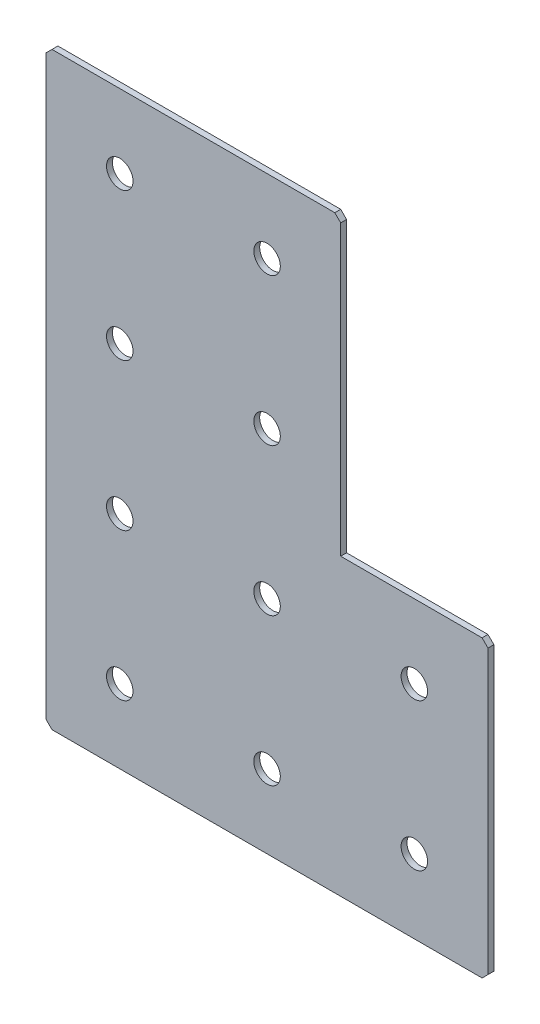
ISO-10303-21;
HEADER;
FILE_DESCRIPTION(('STEP AP214'),'2;1');
FILE_NAME('part.step','',(''),(''),'','','');
FILE_SCHEMA(('AUTOMOTIVE_DESIGN { 1 0 10303 214 1 1 1 1 }'));
ENDSEC;
DATA;
#1=APPLICATION_CONTEXT('core data for automotive mechanical design processes');
#2=APPLICATION_PROTOCOL_DEFINITION('international standard','automotive_design',2000,#1);
#3=PRODUCT_CONTEXT('',#1,'mechanical');
#4=PRODUCT('Part','Part','',(#3));
#5=PRODUCT_RELATED_PRODUCT_CATEGORY('part','',(#4));
#6=PRODUCT_DEFINITION_FORMATION('','',#4);
#7=PRODUCT_DEFINITION_CONTEXT('part definition',#1,'design');
#8=PRODUCT_DEFINITION('design','',#6,#7);
#9=PRODUCT_DEFINITION_SHAPE('','',#8);
#10=(LENGTH_UNIT() NAMED_UNIT(*) SI_UNIT(.MILLI.,.METRE.));
#11=(NAMED_UNIT(*) PLANE_ANGLE_UNIT() SI_UNIT($,.RADIAN.));
#12=(NAMED_UNIT(*) SI_UNIT($,.STERADIAN.) SOLID_ANGLE_UNIT());
#13=UNCERTAINTY_MEASURE_WITH_UNIT(LENGTH_MEASURE(1.E-05),#10,'distance_accuracy_value','');
#14=(GEOMETRIC_REPRESENTATION_CONTEXT(3) GLOBAL_UNCERTAINTY_ASSIGNED_CONTEXT((#13)) GLOBAL_UNIT_ASSIGNED_CONTEXT((#10,
#11,#12)) REPRESENTATION_CONTEXT('',''));
#15=CARTESIAN_POINT('',(0.,0.,0.));
#16=DIRECTION('',(0.,0.,1.));
#17=DIRECTION('',(1.,0.,0.));
#18=AXIS2_PLACEMENT_3D('',#15,#16,#17);
#19=CARTESIAN_POINT('',(100.,0.,-2.));
#20=DIRECTION('',(0.,-1.,0.));
#21=DIRECTION('',(1.,0.,0.));
#22=AXIS2_PLACEMENT_3D('',#19,#20,#21);
#23=PLANE('',#22);
#24=DIRECTION('',(1.,0.,0.));
#25=VECTOR('',#24,1.);
#26=CARTESIAN_POINT('',(100.,0.,0.));
#27=LINE('',#26,#25);
#28=CARTESIAN_POINT('',(2.,0.,0.));
#29=VERTEX_POINT('',#28);
#30=CARTESIAN_POINT('',(98.,0.,0.));
#31=VERTEX_POINT('',#30);
#32=EDGE_CURVE('E158',#29,#31,#27,.T.);
#33=ORIENTED_EDGE('',*,*,#32,.T.);
#34=DIRECTION('',(0.,0.,-1.));
#35=VECTOR('',#34,1.);
#36=CARTESIAN_POINT('',(98.,0.,-2.));
#37=LINE('',#36,#35);
#38=CARTESIAN_POINT('',(98.,0.,-2.));
#39=VERTEX_POINT('',#38);
#40=EDGE_CURVE('E201',#31,#39,#37,.T.);
#41=ORIENTED_EDGE('',*,*,#40,.T.);
#42=DIRECTION('',(1.,0.,0.));
#43=VECTOR('',#42,1.);
#44=CARTESIAN_POINT('',(100.,0.,-2.));
#45=LINE('',#44,#43);
#46=CARTESIAN_POINT('',(2.,0.,-2.));
#47=VERTEX_POINT('',#46);
#48=EDGE_CURVE('E133',#47,#39,#45,.T.);
#49=ORIENTED_EDGE('',*,*,#48,.F.);
#50=DIRECTION('',(0.,0.,1.));
#51=VECTOR('',#50,1.);
#52=CARTESIAN_POINT('',(2.,0.,-2.));
#53=LINE('',#52,#51);
#54=EDGE_CURVE('E198',#47,#29,#53,.T.);
#55=ORIENTED_EDGE('',*,*,#54,.T.);
#56=EDGE_LOOP('',(#33,#41,#49,#55));
#57=FACE_BOUND('',#56,.T.);
#58=ADVANCED_FACE('F37',(#57),#23,.F.);
#59=CARTESIAN_POINT('',(100.,-100.,-2.));
#60=DIRECTION('',(-1.,0.,0.));
#61=DIRECTION('',(0.,-1.,0.));
#62=AXIS2_PLACEMENT_3D('',#59,#60,#61);
#63=PLANE('',#62);
#64=DIRECTION('',(0.,-1.,0.));
#65=VECTOR('',#64,1.);
#66=CARTESIAN_POINT('',(100.,-100.,-2.));
#67=LINE('',#66,#65);
#68=CARTESIAN_POINT('',(100.,-1.99999999999995,-2.));
#69=VERTEX_POINT('',#68);
#70=CARTESIAN_POINT('',(100.,-100.,-2.));
#71=VERTEX_POINT('',#70);
#72=EDGE_CURVE('E121',#69,#71,#67,.T.);
#73=ORIENTED_EDGE('',*,*,#72,.F.);
#74=DIRECTION('',(0.,0.,1.));
#75=VECTOR('',#74,1.);
#76=CARTESIAN_POINT('',(100.,-1.99999999999995,-2.));
#77=LINE('',#76,#75);
#78=CARTESIAN_POINT('',(100.,-1.99999999999995,0.));
#79=VERTEX_POINT('',#78);
#80=EDGE_CURVE('E196',#69,#79,#77,.T.);
#81=ORIENTED_EDGE('',*,*,#80,.T.);
#82=DIRECTION('',(0.,-1.,0.));
#83=VECTOR('',#82,1.);
#84=CARTESIAN_POINT('',(100.,-100.,0.));
#85=LINE('',#84,#83);
#86=CARTESIAN_POINT('',(100.,-100.,0.));
#87=VERTEX_POINT('',#86);
#88=EDGE_CURVE('E139',#79,#87,#85,.T.);
#89=ORIENTED_EDGE('',*,*,#88,.T.);
#90=DIRECTION('',(0.,0.,1.));
#91=VECTOR('',#90,1.);
#92=CARTESIAN_POINT('',(100.,-100.,-2.));
#93=LINE('',#92,#91);
#94=EDGE_CURVE('E136',#71,#87,#93,.T.);
#95=ORIENTED_EDGE('',*,*,#94,.F.);
#96=EDGE_LOOP('',(#73,#81,#89,#95));
#97=FACE_BOUND('',#96,.T.);
#98=ADVANCED_FACE('F137',(#97),#63,.F.);
#99=CARTESIAN_POINT('',(150.,-100.,-2.));
#100=DIRECTION('',(0.,-1.,0.));
#101=DIRECTION('',(0.,0.,-1.));
#102=AXIS2_PLACEMENT_3D('',#99,#100,#101);
#103=PLANE('',#102);
#104=DIRECTION('',(1.,0.,0.));
#105=VECTOR('',#104,1.);
#106=CARTESIAN_POINT('',(150.,-100.,0.));
#107=LINE('',#106,#105);
#108=CARTESIAN_POINT('',(148.,-100.,0.));
#109=VERTEX_POINT('',#108);
#110=EDGE_CURVE('E163',#87,#109,#107,.T.);
#111=ORIENTED_EDGE('',*,*,#110,.T.);
#112=DIRECTION('',(0.,0.,-1.));
#113=VECTOR('',#112,1.);
#114=CARTESIAN_POINT('',(148.,-100.,-2.));
#115=LINE('',#114,#113);
#116=CARTESIAN_POINT('',(148.,-100.,-2.));
#117=VERTEX_POINT('',#116);
#118=EDGE_CURVE('E148',#109,#117,#115,.T.);
#119=ORIENTED_EDGE('',*,*,#118,.T.);
#120=DIRECTION('',(1.,0.,0.));
#121=VECTOR('',#120,1.);
#122=CARTESIAN_POINT('',(150.,-100.,-2.));
#123=LINE('',#122,#121);
#124=EDGE_CURVE('E125',#71,#117,#123,.T.);
#125=ORIENTED_EDGE('',*,*,#124,.F.);
#126=ORIENTED_EDGE('',*,*,#94,.T.);
#127=EDGE_LOOP('',(#111,#119,#125,#126));
#128=FACE_BOUND('',#127,.T.);
#129=ADVANCED_FACE('F146',(#128),#103,.F.);
#130=CARTESIAN_POINT('',(150.,-200.,-2.));
#131=DIRECTION('',(-1.,0.,0.));
#132=DIRECTION('',(0.,-1.,0.));
#133=AXIS2_PLACEMENT_3D('',#130,#131,#132);
#134=PLANE('',#133);
#135=DIRECTION('',(0.,-1.,0.));
#136=VECTOR('',#135,1.);
#137=CARTESIAN_POINT('',(150.,-200.,-2.));
#138=LINE('',#137,#136);
#139=CARTESIAN_POINT('',(150.,-102.,-2.));
#140=VERTEX_POINT('',#139);
#141=CARTESIAN_POINT('',(150.,-198.,-2.));
#142=VERTEX_POINT('',#141);
#143=EDGE_CURVE('E149',#140,#142,#138,.T.);
#144=ORIENTED_EDGE('',*,*,#143,.F.);
#145=DIRECTION('',(0.,0.,1.));
#146=VECTOR('',#145,1.);
#147=CARTESIAN_POINT('',(150.,-102.,-2.));
#148=LINE('',#147,#146);
#149=CARTESIAN_POINT('',(150.,-102.,0.));
#150=VERTEX_POINT('',#149);
#151=EDGE_CURVE('E174',#140,#150,#148,.T.);
#152=ORIENTED_EDGE('',*,*,#151,.T.);
#153=DIRECTION('',(0.,-1.,0.));
#154=VECTOR('',#153,1.);
#155=CARTESIAN_POINT('',(150.,-200.,0.));
#156=LINE('',#155,#154);
#157=CARTESIAN_POINT('',(150.,-198.,0.));
#158=VERTEX_POINT('',#157);
#159=EDGE_CURVE('E165',#150,#158,#156,.T.);
#160=ORIENTED_EDGE('',*,*,#159,.T.);
#161=DIRECTION('',(0.,0.,-1.));
#162=VECTOR('',#161,1.);
#163=CARTESIAN_POINT('',(150.,-198.,-2.));
#164=LINE('',#163,#162);
#165=EDGE_CURVE('E143',#158,#142,#164,.T.);
#166=ORIENTED_EDGE('',*,*,#165,.T.);
#167=EDGE_LOOP('',(#144,#152,#160,#166));
#168=FACE_BOUND('',#167,.T.);
#169=ADVANCED_FACE('F353',(#168),#134,.F.);
#170=CARTESIAN_POINT('',(0.,-200.,-2.));
#171=DIRECTION('',(0.,1.,0.));
#172=DIRECTION('',(0.,0.,1.));
#173=AXIS2_PLACEMENT_3D('',#170,#171,#172);
#174=PLANE('',#173);
#175=DIRECTION('',(-1.,0.,0.));
#176=VECTOR('',#175,1.);
#177=CARTESIAN_POINT('',(0.,-200.,-2.));
#178=LINE('',#177,#176);
#179=CARTESIAN_POINT('',(148.,-200.,-2.));
#180=VERTEX_POINT('',#179);
#181=CARTESIAN_POINT('',(2.00000000000003,-200.,-2.));
#182=VERTEX_POINT('',#181);
#183=EDGE_CURVE('E152',#180,#182,#178,.T.);
#184=ORIENTED_EDGE('',*,*,#183,.F.);
#185=DIRECTION('',(0.,0.,1.));
#186=VECTOR('',#185,1.);
#187=CARTESIAN_POINT('',(148.,-200.,-2.));
#188=LINE('',#187,#186);
#189=CARTESIAN_POINT('',(148.,-200.,0.));
#190=VERTEX_POINT('',#189);
#191=EDGE_CURVE('E11',#180,#190,#188,.T.);
#192=ORIENTED_EDGE('',*,*,#191,.T.);
#193=DIRECTION('',(-1.,0.,0.));
#194=VECTOR('',#193,1.);
#195=CARTESIAN_POINT('',(0.,-200.,0.));
#196=LINE('',#195,#194);
#197=CARTESIAN_POINT('',(2.00000000000003,-200.,0.));
#198=VERTEX_POINT('',#197);
#199=EDGE_CURVE('E168',#190,#198,#196,.T.);
#200=ORIENTED_EDGE('',*,*,#199,.T.);
#201=DIRECTION('',(0.,0.,-1.));
#202=VECTOR('',#201,1.);
#203=CARTESIAN_POINT('',(2.00000000000003,-200.,-2.));
#204=LINE('',#203,#202);
#205=EDGE_CURVE('E45',#198,#182,#204,.T.);
#206=ORIENTED_EDGE('',*,*,#205,.T.);
#207=EDGE_LOOP('',(#184,#192,#200,#206));
#208=FACE_BOUND('',#207,.T.);
#209=ADVANCED_FACE('F209',(#208),#174,.F.);
#210=CARTESIAN_POINT('',(0.,0.,-2.));
#211=DIRECTION('',(1.,0.,0.));
#212=DIRECTION('',(0.,0.,-1.));
#213=AXIS2_PLACEMENT_3D('',#210,#211,#212);
#214=PLANE('',#213);
#215=DIRECTION('',(0.,1.,0.));
#216=VECTOR('',#215,1.);
#217=CARTESIAN_POINT('',(0.,0.,0.));
#218=LINE('',#217,#216);
#219=CARTESIAN_POINT('',(0.,-198.,0.));
#220=VERTEX_POINT('',#219);
#221=CARTESIAN_POINT('',(0.,-2.,0.));
#222=VERTEX_POINT('',#221);
#223=EDGE_CURVE('E171',#220,#222,#218,.T.);
#224=ORIENTED_EDGE('',*,*,#223,.T.);
#225=DIRECTION('',(0.,0.,-1.));
#226=VECTOR('',#225,1.);
#227=CARTESIAN_POINT('',(0.,-2.,-2.));
#228=LINE('',#227,#226);
#229=CARTESIAN_POINT('',(0.,-2.,-2.));
#230=VERTEX_POINT('',#229);
#231=EDGE_CURVE('E52',#222,#230,#228,.T.);
#232=ORIENTED_EDGE('',*,*,#231,.T.);
#233=DIRECTION('',(0.,1.,0.));
#234=VECTOR('',#233,1.);
#235=CARTESIAN_POINT('',(0.,0.,-2.));
#236=LINE('',#235,#234);
#237=CARTESIAN_POINT('',(0.,-198.,-2.));
#238=VERTEX_POINT('',#237);
#239=EDGE_CURVE('E144',#238,#230,#236,.T.);
#240=ORIENTED_EDGE('',*,*,#239,.F.);
#241=DIRECTION('',(0.,0.,1.));
#242=VECTOR('',#241,1.);
#243=CARTESIAN_POINT('',(0.,-198.,-2.));
#244=LINE('',#243,#242);
#245=EDGE_CURVE('E203',#238,#220,#244,.T.);
#246=ORIENTED_EDGE('',*,*,#245,.T.);
#247=EDGE_LOOP('',(#224,#232,#240,#246));
#248=FACE_BOUND('',#247,.T.);
#249=ADVANCED_FACE('F216',(#248),#214,.F.);
#250=CARTESIAN_POINT('',(0.,0.,-2.));
#251=DIRECTION('',(0.,0.,1.));
#252=DIRECTION('',(1.,0.,0.));
#253=AXIS2_PLACEMENT_3D('',#250,#251,#252);
#254=PLANE('',#253);
#255=CARTESIAN_POINT('',(25.,-175.,-2.00000000000001));
#256=DIRECTION('',(0.,0.,-1.));
#257=DIRECTION('',(0.,1.,0.));
#258=AXIS2_PLACEMENT_3D('',#255,#256,#257);
#259=CIRCLE('',#258,4.5);
#260=CARTESIAN_POINT('',(25.,-170.5,-2.00000000000001));
#261=VERTEX_POINT('',#260);
#262=EDGE_CURVE('E285',#261,#261,#259,.T.);
#263=ORIENTED_EDGE('',*,*,#262,.F.);
#264=EDGE_LOOP('',(#263));
#265=FACE_BOUND('',#264,.T.);
#266=CARTESIAN_POINT('',(25.,-125.,-2.00000000000001));
#267=DIRECTION('',(0.,0.,-1.));
#268=DIRECTION('',(0.,1.,0.));
#269=AXIS2_PLACEMENT_3D('',#266,#267,#268);
#270=CIRCLE('',#269,4.5);
#271=CARTESIAN_POINT('',(25.,-120.5,-2.00000000000001));
#272=VERTEX_POINT('',#271);
#273=EDGE_CURVE('E279',#272,#272,#270,.T.);
#274=ORIENTED_EDGE('',*,*,#273,.F.);
#275=EDGE_LOOP('',(#274));
#276=FACE_BOUND('',#275,.T.);
#277=CARTESIAN_POINT('',(25.,-75.,-2.));
#278=DIRECTION('',(0.,0.,-1.));
#279=DIRECTION('',(0.,1.,0.));
#280=AXIS2_PLACEMENT_3D('',#277,#278,#279);
#281=CIRCLE('',#280,4.5);
#282=CARTESIAN_POINT('',(25.,-70.5,-2.));
#283=VERTEX_POINT('',#282);
#284=EDGE_CURVE('E273',#283,#283,#281,.T.);
#285=ORIENTED_EDGE('',*,*,#284,.F.);
#286=EDGE_LOOP('',(#285));
#287=FACE_BOUND('',#286,.T.);
#288=CARTESIAN_POINT('',(25.,-25.,-2.));
#289=DIRECTION('',(0.,0.,-1.));
#290=DIRECTION('',(0.,1.,0.));
#291=AXIS2_PLACEMENT_3D('',#288,#289,#290);
#292=CIRCLE('',#291,4.5);
#293=CARTESIAN_POINT('',(25.,-20.5,-2.));
#294=VERTEX_POINT('',#293);
#295=EDGE_CURVE('E267',#294,#294,#292,.T.);
#296=ORIENTED_EDGE('',*,*,#295,.F.);
#297=EDGE_LOOP('',(#296));
#298=FACE_BOUND('',#297,.T.);
#299=CARTESIAN_POINT('',(75.,-175.,-2.00000000000001));
#300=DIRECTION('',(0.,0.,-1.));
#301=DIRECTION('',(0.,1.,0.));
#302=AXIS2_PLACEMENT_3D('',#299,#300,#301);
#303=CIRCLE('',#302,4.5);
#304=CARTESIAN_POINT('',(75.,-170.5,-2.00000000000001));
#305=VERTEX_POINT('',#304);
#306=EDGE_CURVE('E261',#305,#305,#303,.T.);
#307=ORIENTED_EDGE('',*,*,#306,.F.);
#308=EDGE_LOOP('',(#307));
#309=FACE_BOUND('',#308,.T.);
#310=CARTESIAN_POINT('',(75.,-125.,-2.00000000000001));
#311=DIRECTION('',(0.,0.,-1.));
#312=DIRECTION('',(0.,1.,0.));
#313=AXIS2_PLACEMENT_3D('',#310,#311,#312);
#314=CIRCLE('',#313,4.5);
#315=CARTESIAN_POINT('',(75.,-120.5,-2.00000000000001));
#316=VERTEX_POINT('',#315);
#317=EDGE_CURVE('E255',#316,#316,#314,.T.);
#318=ORIENTED_EDGE('',*,*,#317,.F.);
#319=EDGE_LOOP('',(#318));
#320=FACE_BOUND('',#319,.T.);
#321=CARTESIAN_POINT('',(75.,-75.,-2.));
#322=DIRECTION('',(0.,0.,-1.));
#323=DIRECTION('',(0.,1.,0.));
#324=AXIS2_PLACEMENT_3D('',#321,#322,#323);
#325=CIRCLE('',#324,4.5);
#326=CARTESIAN_POINT('',(75.,-70.5,-2.));
#327=VERTEX_POINT('',#326);
#328=EDGE_CURVE('E249',#327,#327,#325,.T.);
#329=ORIENTED_EDGE('',*,*,#328,.F.);
#330=EDGE_LOOP('',(#329));
#331=FACE_BOUND('',#330,.T.);
#332=CARTESIAN_POINT('',(75.,-25.,-2.));
#333=DIRECTION('',(0.,0.,-1.));
#334=DIRECTION('',(0.,1.,0.));
#335=AXIS2_PLACEMENT_3D('',#332,#333,#334);
#336=CIRCLE('',#335,4.5);
#337=CARTESIAN_POINT('',(75.,-20.5,-2.));
#338=VERTEX_POINT('',#337);
#339=EDGE_CURVE('E243',#338,#338,#336,.T.);
#340=ORIENTED_EDGE('',*,*,#339,.F.);
#341=EDGE_LOOP('',(#340));
#342=FACE_BOUND('',#341,.T.);
#343=CARTESIAN_POINT('',(125.,-175.,-2.00000000000001));
#344=DIRECTION('',(0.,0.,-1.));
#345=DIRECTION('',(0.,1.,0.));
#346=AXIS2_PLACEMENT_3D('',#343,#344,#345);
#347=CIRCLE('',#346,4.5);
#348=CARTESIAN_POINT('',(125.,-170.5,-2.00000000000001));
#349=VERTEX_POINT('',#348);
#350=EDGE_CURVE('E237',#349,#349,#347,.T.);
#351=ORIENTED_EDGE('',*,*,#350,.F.);
#352=EDGE_LOOP('',(#351));
#353=FACE_BOUND('',#352,.T.);
#354=CARTESIAN_POINT('',(125.,-125.,-2.00000000000001));
#355=DIRECTION('',(0.,0.,-1.));
#356=DIRECTION('',(0.,1.,0.));
#357=AXIS2_PLACEMENT_3D('',#354,#355,#356);
#358=CIRCLE('',#357,4.5);
#359=CARTESIAN_POINT('',(125.,-120.5,-2.00000000000001));
#360=VERTEX_POINT('',#359);
#361=EDGE_CURVE('E231',#360,#360,#358,.T.);
#362=ORIENTED_EDGE('',*,*,#361,.F.);
#363=EDGE_LOOP('',(#362));
#364=FACE_BOUND('',#363,.T.);
#365=ORIENTED_EDGE('',*,*,#124,.T.);
#366=DIRECTION('',(-0.707106781186548,0.707106781186548,0.));
#367=VECTOR('',#366,1.);
#368=CARTESIAN_POINT('',(150.,-102.,-2.));
#369=LINE('',#368,#367);
#370=EDGE_CURVE('E194',#117,#140,#369,.F.);
#371=ORIENTED_EDGE('',*,*,#370,.T.);
#372=ORIENTED_EDGE('',*,*,#143,.T.);
#373=DIRECTION('',(0.707106781186548,0.707106781186548,0.));
#374=VECTOR('',#373,1.);
#375=CARTESIAN_POINT('',(148.,-200.,-2.));
#376=LINE('',#375,#374);
#377=EDGE_CURVE('E189',#142,#180,#376,.F.);
#378=ORIENTED_EDGE('',*,*,#377,.T.);
#379=ORIENTED_EDGE('',*,*,#183,.T.);
#380=DIRECTION('',(0.707106781186548,-0.707106781186548,0.));
#381=VECTOR('',#380,1.);
#382=CARTESIAN_POINT('',(0.,-198.,-2.));
#383=LINE('',#382,#381);
#384=EDGE_CURVE('E59',#182,#238,#383,.F.);
#385=ORIENTED_EDGE('',*,*,#384,.T.);
#386=ORIENTED_EDGE('',*,*,#239,.T.);
#387=DIRECTION('',(-0.707106781186548,-0.707106781186548,0.));
#388=VECTOR('',#387,1.);
#389=CARTESIAN_POINT('',(2.,0.,-2.));
#390=LINE('',#389,#388);
#391=EDGE_CURVE('E191',#230,#47,#390,.F.);
#392=ORIENTED_EDGE('',*,*,#391,.T.);
#393=ORIENTED_EDGE('',*,*,#48,.T.);
#394=DIRECTION('',(-0.707106781186553,0.707106781186542,0.));
#395=VECTOR('',#394,1.);
#396=CARTESIAN_POINT('',(100.,-1.99999999999995,-2.));
#397=LINE('',#396,#395);
#398=EDGE_CURVE('E129',#39,#69,#397,.F.);
#399=ORIENTED_EDGE('',*,*,#398,.T.);
#400=ORIENTED_EDGE('',*,*,#72,.T.);
#401=EDGE_LOOP('',(#365,#371,#372,#378,#379,#385,#386,#392,#393,#399,#400));
#402=FACE_BOUND('',#401,.T.);
#403=ADVANCED_FACE('F123',(#265,#276,#287,#298,#309,#320,#331,#342,#353,#364,#402),#254,.F.);
#404=CARTESIAN_POINT('',(0.,0.,0.));
#405=DIRECTION('',(0.,0.,1.));
#406=DIRECTION('',(1.,0.,0.));
#407=AXIS2_PLACEMENT_3D('',#404,#405,#406);
#408=PLANE('',#407);
#409=CARTESIAN_POINT('',(25.,-175.,0.));
#410=DIRECTION('',(0.,0.,-1.));
#411=DIRECTION('',(0.,1.,0.));
#412=AXIS2_PLACEMENT_3D('',#409,#410,#411);
#413=CIRCLE('',#412,4.5);
#414=CARTESIAN_POINT('',(25.,-170.5,0.));
#415=VERTEX_POINT('',#414);
#416=EDGE_CURVE('E282',#415,#415,#413,.T.);
#417=ORIENTED_EDGE('',*,*,#416,.T.);
#418=EDGE_LOOP('',(#417));
#419=FACE_BOUND('',#418,.T.);
#420=CARTESIAN_POINT('',(25.,-125.,0.));
#421=DIRECTION('',(0.,0.,-1.));
#422=DIRECTION('',(0.,1.,0.));
#423=AXIS2_PLACEMENT_3D('',#420,#421,#422);
#424=CIRCLE('',#423,4.5);
#425=CARTESIAN_POINT('',(25.,-120.5,0.));
#426=VERTEX_POINT('',#425);
#427=EDGE_CURVE('E276',#426,#426,#424,.T.);
#428=ORIENTED_EDGE('',*,*,#427,.T.);
#429=EDGE_LOOP('',(#428));
#430=FACE_BOUND('',#429,.T.);
#431=CARTESIAN_POINT('',(25.,-75.,0.));
#432=DIRECTION('',(0.,0.,-1.));
#433=DIRECTION('',(0.,1.,0.));
#434=AXIS2_PLACEMENT_3D('',#431,#432,#433);
#435=CIRCLE('',#434,4.5);
#436=CARTESIAN_POINT('',(25.,-70.5,0.));
#437=VERTEX_POINT('',#436);
#438=EDGE_CURVE('E270',#437,#437,#435,.T.);
#439=ORIENTED_EDGE('',*,*,#438,.T.);
#440=EDGE_LOOP('',(#439));
#441=FACE_BOUND('',#440,.T.);
#442=CARTESIAN_POINT('',(25.,-25.,0.));
#443=DIRECTION('',(0.,0.,-1.));
#444=DIRECTION('',(0.,1.,0.));
#445=AXIS2_PLACEMENT_3D('',#442,#443,#444);
#446=CIRCLE('',#445,4.5);
#447=CARTESIAN_POINT('',(25.,-20.5,0.));
#448=VERTEX_POINT('',#447);
#449=EDGE_CURVE('E264',#448,#448,#446,.T.);
#450=ORIENTED_EDGE('',*,*,#449,.T.);
#451=EDGE_LOOP('',(#450));
#452=FACE_BOUND('',#451,.T.);
#453=CARTESIAN_POINT('',(75.,-175.,0.));
#454=DIRECTION('',(0.,0.,-1.));
#455=DIRECTION('',(0.,1.,0.));
#456=AXIS2_PLACEMENT_3D('',#453,#454,#455);
#457=CIRCLE('',#456,4.5);
#458=CARTESIAN_POINT('',(75.,-170.5,0.));
#459=VERTEX_POINT('',#458);
#460=EDGE_CURVE('E258',#459,#459,#457,.T.);
#461=ORIENTED_EDGE('',*,*,#460,.T.);
#462=EDGE_LOOP('',(#461));
#463=FACE_BOUND('',#462,.T.);
#464=CARTESIAN_POINT('',(75.,-125.,0.));
#465=DIRECTION('',(0.,0.,-1.));
#466=DIRECTION('',(0.,1.,0.));
#467=AXIS2_PLACEMENT_3D('',#464,#465,#466);
#468=CIRCLE('',#467,4.5);
#469=CARTESIAN_POINT('',(75.,-120.5,0.));
#470=VERTEX_POINT('',#469);
#471=EDGE_CURVE('E252',#470,#470,#468,.T.);
#472=ORIENTED_EDGE('',*,*,#471,.T.);
#473=EDGE_LOOP('',(#472));
#474=FACE_BOUND('',#473,.T.);
#475=CARTESIAN_POINT('',(75.,-75.,0.));
#476=DIRECTION('',(0.,0.,-1.));
#477=DIRECTION('',(0.,1.,0.));
#478=AXIS2_PLACEMENT_3D('',#475,#476,#477);
#479=CIRCLE('',#478,4.5);
#480=CARTESIAN_POINT('',(75.,-70.5,0.));
#481=VERTEX_POINT('',#480);
#482=EDGE_CURVE('E246',#481,#481,#479,.T.);
#483=ORIENTED_EDGE('',*,*,#482,.T.);
#484=EDGE_LOOP('',(#483));
#485=FACE_BOUND('',#484,.T.);
#486=CARTESIAN_POINT('',(75.,-25.,0.));
#487=DIRECTION('',(0.,0.,-1.));
#488=DIRECTION('',(0.,1.,0.));
#489=AXIS2_PLACEMENT_3D('',#486,#487,#488);
#490=CIRCLE('',#489,4.5);
#491=CARTESIAN_POINT('',(75.,-20.5,0.));
#492=VERTEX_POINT('',#491);
#493=EDGE_CURVE('E240',#492,#492,#490,.T.);
#494=ORIENTED_EDGE('',*,*,#493,.T.);
#495=EDGE_LOOP('',(#494));
#496=FACE_BOUND('',#495,.T.);
#497=CARTESIAN_POINT('',(125.,-175.,0.));
#498=DIRECTION('',(0.,0.,-1.));
#499=DIRECTION('',(0.,1.,0.));
#500=AXIS2_PLACEMENT_3D('',#497,#498,#499);
#501=CIRCLE('',#500,4.5);
#502=CARTESIAN_POINT('',(125.,-170.5,0.));
#503=VERTEX_POINT('',#502);
#504=EDGE_CURVE('E234',#503,#503,#501,.T.);
#505=ORIENTED_EDGE('',*,*,#504,.T.);
#506=EDGE_LOOP('',(#505));
#507=FACE_BOUND('',#506,.T.);
#508=CARTESIAN_POINT('',(125.,-125.,0.));
#509=DIRECTION('',(0.,0.,-1.));
#510=DIRECTION('',(0.,1.,0.));
#511=AXIS2_PLACEMENT_3D('',#508,#509,#510);
#512=CIRCLE('',#511,4.5);
#513=CARTESIAN_POINT('',(125.,-120.5,0.));
#514=VERTEX_POINT('',#513);
#515=EDGE_CURVE('E161',#514,#514,#512,.T.);
#516=ORIENTED_EDGE('',*,*,#515,.T.);
#517=EDGE_LOOP('',(#516));
#518=FACE_BOUND('',#517,.T.);
#519=ORIENTED_EDGE('',*,*,#159,.F.);
#520=DIRECTION('',(0.707106781186548,-0.707106781186548,0.));
#521=VECTOR('',#520,1.);
#522=CARTESIAN_POINT('',(24.,24.,0.));
#523=LINE('',#522,#521);
#524=EDGE_CURVE('E185',#150,#109,#523,.F.);
#525=ORIENTED_EDGE('',*,*,#524,.T.);
#526=ORIENTED_EDGE('',*,*,#110,.F.);
#527=ORIENTED_EDGE('',*,*,#88,.F.);
#528=DIRECTION('',(0.707106781186553,-0.707106781186542,0.));
#529=VECTOR('',#528,1.);
#530=CARTESIAN_POINT('',(48.9999999999993,49.,0.));
#531=LINE('',#530,#529);
#532=EDGE_CURVE('E183',#79,#31,#531,.F.);
#533=ORIENTED_EDGE('',*,*,#532,.T.);
#534=ORIENTED_EDGE('',*,*,#32,.F.);
#535=DIRECTION('',(0.707106781186548,0.707106781186548,0.));
#536=VECTOR('',#535,1.);
#537=CARTESIAN_POINT('',(1.,-1.,0.));
#538=LINE('',#537,#536);
#539=EDGE_CURVE('E181',#29,#222,#538,.F.);
#540=ORIENTED_EDGE('',*,*,#539,.T.);
#541=ORIENTED_EDGE('',*,*,#223,.F.);
#542=DIRECTION('',(-0.707106781186548,0.707106781186548,0.));
#543=VECTOR('',#542,1.);
#544=CARTESIAN_POINT('',(-99.,-99.,0.));
#545=LINE('',#544,#543);
#546=EDGE_CURVE('E177',#220,#198,#545,.F.);
#547=ORIENTED_EDGE('',*,*,#546,.T.);
#548=ORIENTED_EDGE('',*,*,#199,.F.);
#549=DIRECTION('',(-0.707106781186548,-0.707106781186548,0.));
#550=VECTOR('',#549,1.);
#551=CARTESIAN_POINT('',(174.,-174.,0.));
#552=LINE('',#551,#550);
#553=EDGE_CURVE('E179',#190,#158,#552,.F.);
#554=ORIENTED_EDGE('',*,*,#553,.T.);
#555=EDGE_LOOP('',(#519,#525,#526,#527,#533,#534,#540,#541,#547,#548,#554));
#556=FACE_BOUND('',#555,.T.);
#557=ADVANCED_FACE('F219',(#419,#430,#441,#452,#463,#474,#485,#496,#507,#518,#556),#408,.T.);
#558=CARTESIAN_POINT('',(125.,-125.,-2.00000000000001));
#559=DIRECTION('',(0.,0.,-1.));
#560=DIRECTION('',(0.,1.,0.));
#561=AXIS2_PLACEMENT_3D('',#558,#559,#560);
#562=CYLINDRICAL_SURFACE('',#561,4.5);
#563=ORIENTED_EDGE('',*,*,#515,.F.);
#564=EDGE_LOOP('',(#563));
#565=FACE_BOUND('',#564,.T.);
#566=ORIENTED_EDGE('',*,*,#361,.T.);
#567=EDGE_LOOP('',(#566));
#568=FACE_BOUND('',#567,.T.);
#569=ADVANCED_FACE('F312',(#565,#568),#562,.F.);
#570=CARTESIAN_POINT('',(125.,-175.,-2.00000000000001));
#571=DIRECTION('',(0.,0.,-1.));
#572=DIRECTION('',(0.,1.,0.));
#573=AXIS2_PLACEMENT_3D('',#570,#571,#572);
#574=CYLINDRICAL_SURFACE('',#573,4.5);
#575=ORIENTED_EDGE('',*,*,#504,.F.);
#576=EDGE_LOOP('',(#575));
#577=FACE_BOUND('',#576,.T.);
#578=ORIENTED_EDGE('',*,*,#350,.T.);
#579=EDGE_LOOP('',(#578));
#580=FACE_BOUND('',#579,.T.);
#581=ADVANCED_FACE('F314',(#577,#580),#574,.F.);
#582=CARTESIAN_POINT('',(75.,-25.,-2.));
#583=DIRECTION('',(0.,0.,-1.));
#584=DIRECTION('',(0.,1.,0.));
#585=AXIS2_PLACEMENT_3D('',#582,#583,#584);
#586=CYLINDRICAL_SURFACE('',#585,4.5);
#587=ORIENTED_EDGE('',*,*,#493,.F.);
#588=EDGE_LOOP('',(#587));
#589=FACE_BOUND('',#588,.T.);
#590=ORIENTED_EDGE('',*,*,#339,.T.);
#591=EDGE_LOOP('',(#590));
#592=FACE_BOUND('',#591,.T.);
#593=ADVANCED_FACE('F321',(#589,#592),#586,.F.);
#594=CARTESIAN_POINT('',(75.,-75.,-2.));
#595=DIRECTION('',(0.,0.,-1.));
#596=DIRECTION('',(0.,1.,0.));
#597=AXIS2_PLACEMENT_3D('',#594,#595,#596);
#598=CYLINDRICAL_SURFACE('',#597,4.5);
#599=ORIENTED_EDGE('',*,*,#482,.F.);
#600=EDGE_LOOP('',(#599));
#601=FACE_BOUND('',#600,.T.);
#602=ORIENTED_EDGE('',*,*,#328,.T.);
#603=EDGE_LOOP('',(#602));
#604=FACE_BOUND('',#603,.T.);
#605=ADVANCED_FACE('F453',(#601,#604),#598,.F.);
#606=CARTESIAN_POINT('',(75.,-125.,-2.00000000000001));
#607=DIRECTION('',(0.,0.,-1.));
#608=DIRECTION('',(0.,1.,0.));
#609=AXIS2_PLACEMENT_3D('',#606,#607,#608);
#610=CYLINDRICAL_SURFACE('',#609,4.5);
#611=ORIENTED_EDGE('',*,*,#471,.F.);
#612=EDGE_LOOP('',(#611));
#613=FACE_BOUND('',#612,.T.);
#614=ORIENTED_EDGE('',*,*,#317,.T.);
#615=EDGE_LOOP('',(#614));
#616=FACE_BOUND('',#615,.T.);
#617=ADVANCED_FACE('F445',(#613,#616),#610,.F.);
#618=CARTESIAN_POINT('',(75.,-175.,-2.00000000000001));
#619=DIRECTION('',(0.,0.,-1.));
#620=DIRECTION('',(0.,1.,0.));
#621=AXIS2_PLACEMENT_3D('',#618,#619,#620);
#622=CYLINDRICAL_SURFACE('',#621,4.5);
#623=ORIENTED_EDGE('',*,*,#460,.F.);
#624=EDGE_LOOP('',(#623));
#625=FACE_BOUND('',#624,.T.);
#626=ORIENTED_EDGE('',*,*,#306,.T.);
#627=EDGE_LOOP('',(#626));
#628=FACE_BOUND('',#627,.T.);
#629=ADVANCED_FACE('F437',(#625,#628),#622,.F.);
#630=CARTESIAN_POINT('',(25.,-25.,-2.));
#631=DIRECTION('',(0.,0.,-1.));
#632=DIRECTION('',(0.,1.,0.));
#633=AXIS2_PLACEMENT_3D('',#630,#631,#632);
#634=CYLINDRICAL_SURFACE('',#633,4.5);
#635=ORIENTED_EDGE('',*,*,#449,.F.);
#636=EDGE_LOOP('',(#635));
#637=FACE_BOUND('',#636,.T.);
#638=ORIENTED_EDGE('',*,*,#295,.T.);
#639=EDGE_LOOP('',(#638));
#640=FACE_BOUND('',#639,.T.);
#641=ADVANCED_FACE('F429',(#637,#640),#634,.F.);
#642=CARTESIAN_POINT('',(25.,-75.,-2.));
#643=DIRECTION('',(0.,0.,-1.));
#644=DIRECTION('',(0.,1.,0.));
#645=AXIS2_PLACEMENT_3D('',#642,#643,#644);
#646=CYLINDRICAL_SURFACE('',#645,4.5);
#647=ORIENTED_EDGE('',*,*,#438,.F.);
#648=EDGE_LOOP('',(#647));
#649=FACE_BOUND('',#648,.T.);
#650=ORIENTED_EDGE('',*,*,#284,.T.);
#651=EDGE_LOOP('',(#650));
#652=FACE_BOUND('',#651,.T.);
#653=ADVANCED_FACE('F421',(#649,#652),#646,.F.);
#654=CARTESIAN_POINT('',(25.,-125.,-2.00000000000001));
#655=DIRECTION('',(0.,0.,-1.));
#656=DIRECTION('',(0.,1.,0.));
#657=AXIS2_PLACEMENT_3D('',#654,#655,#656);
#658=CYLINDRICAL_SURFACE('',#657,4.5);
#659=ORIENTED_EDGE('',*,*,#427,.F.);
#660=EDGE_LOOP('',(#659));
#661=FACE_BOUND('',#660,.T.);
#662=ORIENTED_EDGE('',*,*,#273,.T.);
#663=EDGE_LOOP('',(#662));
#664=FACE_BOUND('',#663,.T.);
#665=ADVANCED_FACE('F414',(#661,#664),#658,.F.);
#666=CARTESIAN_POINT('',(25.,-175.,-2.00000000000001));
#667=DIRECTION('',(0.,0.,-1.));
#668=DIRECTION('',(0.,1.,0.));
#669=AXIS2_PLACEMENT_3D('',#666,#667,#668);
#670=CYLINDRICAL_SURFACE('',#669,4.5);
#671=ORIENTED_EDGE('',*,*,#416,.F.);
#672=EDGE_LOOP('',(#671));
#673=FACE_BOUND('',#672,.T.);
#674=ORIENTED_EDGE('',*,*,#262,.T.);
#675=EDGE_LOOP('',(#674));
#676=FACE_BOUND('',#675,.T.);
#677=ADVANCED_FACE('F289',(#673,#676),#670,.F.);
#678=CARTESIAN_POINT('',(150.,-102.,-2.));
#679=DIRECTION('',(-0.707106781186547,-0.707106781186547,0.));
#680=DIRECTION('',(0.,0.,1.));
#681=AXIS2_PLACEMENT_3D('',#678,#679,#680);
#682=PLANE('',#681);
#683=ORIENTED_EDGE('',*,*,#370,.F.);
#684=ORIENTED_EDGE('',*,*,#118,.F.);
#685=ORIENTED_EDGE('',*,*,#524,.F.);
#686=ORIENTED_EDGE('',*,*,#151,.F.);
#687=EDGE_LOOP('',(#683,#684,#685,#686));
#688=FACE_BOUND('',#687,.T.);
#689=ADVANCED_FACE('F335',(#688),#682,.F.);
#690=CARTESIAN_POINT('',(100.,-1.99999999999995,-2.));
#691=DIRECTION('',(-0.707106781186542,-0.707106781186553,0.));
#692=DIRECTION('',(0.,0.,1.));
#693=AXIS2_PLACEMENT_3D('',#690,#691,#692);
#694=PLANE('',#693);
#695=ORIENTED_EDGE('',*,*,#398,.F.);
#696=ORIENTED_EDGE('',*,*,#40,.F.);
#697=ORIENTED_EDGE('',*,*,#532,.F.);
#698=ORIENTED_EDGE('',*,*,#80,.F.);
#699=EDGE_LOOP('',(#695,#696,#697,#698));
#700=FACE_BOUND('',#699,.T.);
#701=ADVANCED_FACE('F338',(#700),#694,.F.);
#702=CARTESIAN_POINT('',(2.,0.,-2.));
#703=DIRECTION('',(0.707106781186547,-0.707106781186547,0.));
#704=DIRECTION('',(0.,0.,1.));
#705=AXIS2_PLACEMENT_3D('',#702,#703,#704);
#706=PLANE('',#705);
#707=ORIENTED_EDGE('',*,*,#391,.F.);
#708=ORIENTED_EDGE('',*,*,#231,.F.);
#709=ORIENTED_EDGE('',*,*,#539,.F.);
#710=ORIENTED_EDGE('',*,*,#54,.F.);
#711=EDGE_LOOP('',(#707,#708,#709,#710));
#712=FACE_BOUND('',#711,.T.);
#713=ADVANCED_FACE('F224',(#712),#706,.F.);
#714=CARTESIAN_POINT('',(148.,-200.,-2.));
#715=DIRECTION('',(-0.707106781186547,0.707106781186547,0.));
#716=DIRECTION('',(0.,0.,1.));
#717=AXIS2_PLACEMENT_3D('',#714,#715,#716);
#718=PLANE('',#717);
#719=ORIENTED_EDGE('',*,*,#377,.F.);
#720=ORIENTED_EDGE('',*,*,#165,.F.);
#721=ORIENTED_EDGE('',*,*,#553,.F.);
#722=ORIENTED_EDGE('',*,*,#191,.F.);
#723=EDGE_LOOP('',(#719,#720,#721,#722));
#724=FACE_BOUND('',#723,.T.);
#725=ADVANCED_FACE('F344',(#724),#718,.F.);
#726=CARTESIAN_POINT('',(0.,-198.,-2.));
#727=DIRECTION('',(0.707106781186547,0.707106781186547,0.));
#728=DIRECTION('',(0.,0.,1.));
#729=AXIS2_PLACEMENT_3D('',#726,#727,#728);
#730=PLANE('',#729);
#731=ORIENTED_EDGE('',*,*,#384,.F.);
#732=ORIENTED_EDGE('',*,*,#205,.F.);
#733=ORIENTED_EDGE('',*,*,#546,.F.);
#734=ORIENTED_EDGE('',*,*,#245,.F.);
#735=EDGE_LOOP('',(#731,#732,#733,#734));
#736=FACE_BOUND('',#735,.T.);
#737=ADVANCED_FACE('F39',(#736),#730,.F.);
#738=CLOSED_SHELL('',(#58,#98,#129,#169,#209,#249,#403,#557,#569,#581,#593,#605,#617,#629,#641,
#653,#665,#677,#689,#701,#713,#725,#737));
#739=MANIFOLD_SOLID_BREP('B2',#738);
#740=ADVANCED_BREP_SHAPE_REPRESENTATION('',(#18,#739),#14);
#741=SHAPE_DEFINITION_REPRESENTATION(#9,#740);
ENDSEC;
END-ISO-10303-21;
